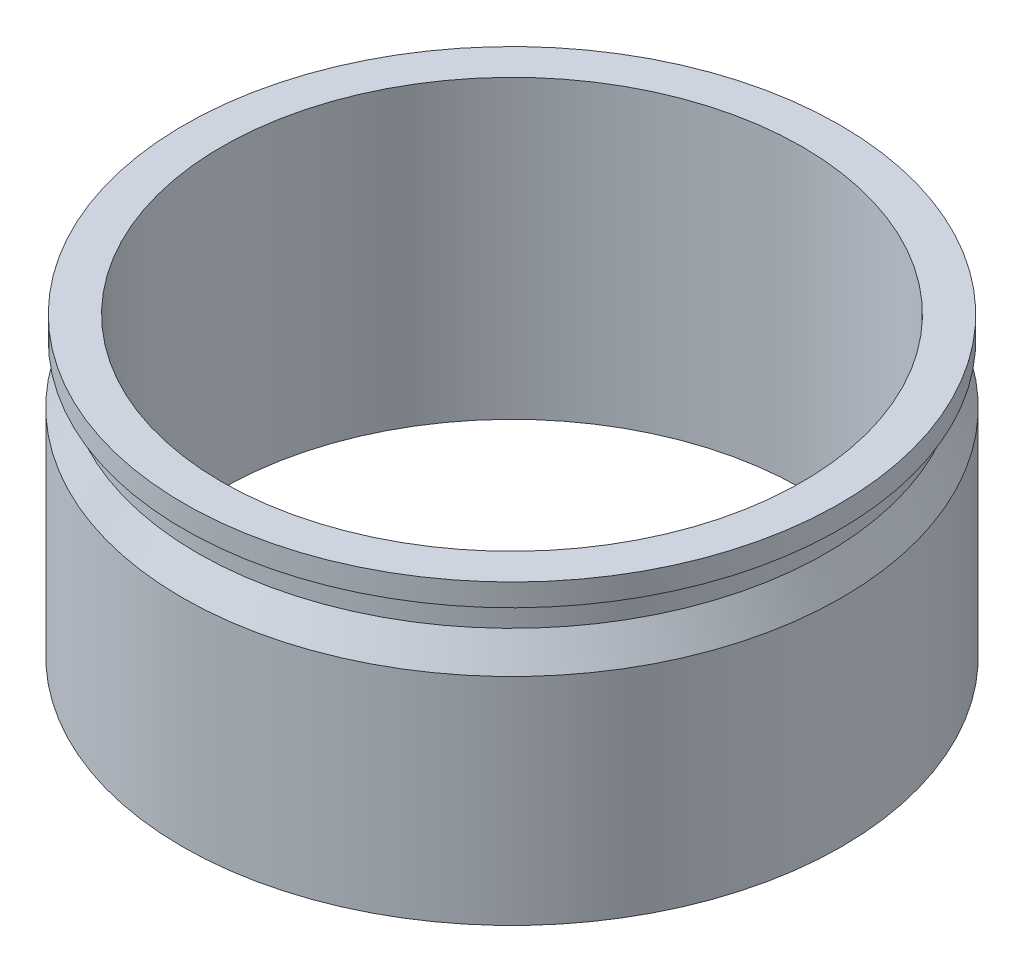
ISO-10303-21;
HEADER;
FILE_DESCRIPTION(('STEP AP214'),'2;1');
FILE_NAME('part.step','',(''),(''),'','','');
FILE_SCHEMA(('AUTOMOTIVE_DESIGN { 1 0 10303 214 1 1 1 1 }'));
ENDSEC;
DATA;
#1=APPLICATION_CONTEXT('core data for automotive mechanical design processes');
#2=APPLICATION_PROTOCOL_DEFINITION('international standard','automotive_design',2000,#1);
#3=PRODUCT_CONTEXT('',#1,'mechanical');
#4=PRODUCT('Part','Part','',(#3));
#5=PRODUCT_RELATED_PRODUCT_CATEGORY('part','',(#4));
#6=PRODUCT_DEFINITION_FORMATION('','',#4);
#7=PRODUCT_DEFINITION_CONTEXT('part definition',#1,'design');
#8=PRODUCT_DEFINITION('design','',#6,#7);
#9=PRODUCT_DEFINITION_SHAPE('','',#8);
#10=(LENGTH_UNIT() NAMED_UNIT(*) SI_UNIT(.MILLI.,.METRE.));
#11=(NAMED_UNIT(*) PLANE_ANGLE_UNIT() SI_UNIT($,.RADIAN.));
#12=(NAMED_UNIT(*) SI_UNIT($,.STERADIAN.) SOLID_ANGLE_UNIT());
#13=UNCERTAINTY_MEASURE_WITH_UNIT(LENGTH_MEASURE(1.E-05),#10,'distance_accuracy_value','');
#14=(GEOMETRIC_REPRESENTATION_CONTEXT(3) GLOBAL_UNCERTAINTY_ASSIGNED_CONTEXT((#13)) GLOBAL_UNIT_ASSIGNED_CONTEXT((#10,
#11,#12)) REPRESENTATION_CONTEXT('',''));
#15=CARTESIAN_POINT('',(0.,0.,0.));
#16=DIRECTION('',(0.,0.,1.));
#17=DIRECTION('',(1.,0.,0.));
#18=AXIS2_PLACEMENT_3D('',#15,#16,#17);
#19=CARTESIAN_POINT('',(-368.749999999999,1707.8376320396,0.));
#20=DIRECTION('',(0.,1.,0.));
#21=DIRECTION('',(0.,0.,1.));
#22=AXIS2_PLACEMENT_3D('',#19,#20,#21);
#23=PLANE('',#22);
#24=CARTESIAN_POINT('',(0.,1707.8376320396,0.));
#25=DIRECTION('',(0.,-1.,0.));
#26=DIRECTION('',(0.,0.,-1.));
#27=AXIS2_PLACEMENT_3D('',#24,#25,#26);
#28=CIRCLE('',#27,325.5);
#29=CARTESIAN_POINT('',(0.,1707.8376320396,-325.500000000001));
#30=VERTEX_POINT('',#29);
#31=EDGE_CURVE('E10',#30,#30,#28,.T.);
#32=ORIENTED_EDGE('',*,*,#31,.F.);
#33=EDGE_LOOP('',(#32));
#34=FACE_BOUND('',#33,.T.);
#35=CARTESIAN_POINT('',(0.,1707.8376320396,0.));
#36=DIRECTION('',(0.,-1.,0.));
#37=DIRECTION('',(0.,0.,-1.));
#38=AXIS2_PLACEMENT_3D('',#35,#36,#37);
#39=CIRCLE('',#38,369.75);
#40=CARTESIAN_POINT('',(0.,1707.8376320396,-369.750000000001));
#41=VERTEX_POINT('',#40);
#42=EDGE_CURVE('E59',#41,#41,#39,.T.);
#43=ORIENTED_EDGE('',*,*,#42,.T.);
#44=EDGE_LOOP('',(#43));
#45=FACE_BOUND('',#44,.T.);
#46=ADVANCED_FACE('F31',(#34,#45),#23,.F.);
#47=CARTESIAN_POINT('',(0.,1764.,0.));
#48=DIRECTION('',(0.,-1.,0.));
#49=DIRECTION('',(0.,0.,-1.));
#50=AXIS2_PLACEMENT_3D('',#47,#48,#49);
#51=CYLINDRICAL_SURFACE('',#50,325.5);
#52=CARTESIAN_POINT('',(0.,2040.,0.));
#53=DIRECTION('',(0.,-1.,0.));
#54=DIRECTION('',(0.,0.,-1.));
#55=AXIS2_PLACEMENT_3D('',#52,#53,#54);
#56=CIRCLE('',#55,325.5);
#57=CARTESIAN_POINT('',(0.,2040.,-325.500000000001));
#58=VERTEX_POINT('',#57);
#59=EDGE_CURVE('E37',#58,#58,#56,.T.);
#60=ORIENTED_EDGE('',*,*,#59,.F.);
#61=EDGE_LOOP('',(#60));
#62=FACE_BOUND('',#61,.T.);
#63=ORIENTED_EDGE('',*,*,#31,.T.);
#64=EDGE_LOOP('',(#63));
#65=FACE_BOUND('',#64,.T.);
#66=ADVANCED_FACE('F127',(#62,#65),#51,.F.);
#67=CARTESIAN_POINT('',(-326.499999999999,2040.,0.));
#68=DIRECTION('',(0.,-1.,0.));
#69=DIRECTION('',(0.,0.,-1.));
#70=AXIS2_PLACEMENT_3D('',#67,#68,#69);
#71=PLANE('',#70);
#72=CARTESIAN_POINT('',(0.,2040.,0.));
#73=DIRECTION('',(0.,-1.,0.));
#74=DIRECTION('',(0.,0.,-1.));
#75=AXIS2_PLACEMENT_3D('',#72,#73,#74);
#76=CIRCLE('',#75,367.75);
#77=CARTESIAN_POINT('',(0.,2040.,-367.750000000001));
#78=VERTEX_POINT('',#77);
#79=EDGE_CURVE('E41',#78,#78,#76,.T.);
#80=ORIENTED_EDGE('',*,*,#79,.F.);
#81=EDGE_LOOP('',(#80));
#82=FACE_BOUND('',#81,.T.);
#83=ORIENTED_EDGE('',*,*,#59,.T.);
#84=EDGE_LOOP('',(#83));
#85=FACE_BOUND('',#84,.T.);
#86=ADVANCED_FACE('F124',(#82,#85),#71,.F.);
#87=CARTESIAN_POINT('',(0.,1764.,0.));
#88=DIRECTION('',(0.,-1.,0.));
#89=DIRECTION('',(0.,0.,-1.));
#90=AXIS2_PLACEMENT_3D('',#87,#88,#89);
#91=CYLINDRICAL_SURFACE('',#90,367.75);
#92=CARTESIAN_POINT('',(0.,2015.,0.));
#93=DIRECTION('',(0.,-1.,0.));
#94=DIRECTION('',(0.,0.,-1.));
#95=AXIS2_PLACEMENT_3D('',#92,#93,#94);
#96=CIRCLE('',#95,367.75);
#97=CARTESIAN_POINT('',(0.,2015.,-367.750000000001));
#98=VERTEX_POINT('',#97);
#99=EDGE_CURVE('E45',#98,#98,#96,.T.);
#100=ORIENTED_EDGE('',*,*,#99,.F.);
#101=EDGE_LOOP('',(#100));
#102=FACE_BOUND('',#101,.T.);
#103=ORIENTED_EDGE('',*,*,#79,.T.);
#104=EDGE_LOOP('',(#103));
#105=FACE_BOUND('',#104,.T.);
#106=ADVANCED_FACE('F120',(#102,#105),#91,.T.);
#107=CARTESIAN_POINT('',(-366.75,2015.,0.));
#108=DIRECTION('',(0.,1.,0.));
#109=DIRECTION('',(0.,0.,1.));
#110=AXIS2_PLACEMENT_3D('',#107,#108,#109);
#111=PLANE('',#110);
#112=CARTESIAN_POINT('',(0.,2015.,0.));
#113=DIRECTION('',(0.,-1.,0.));
#114=DIRECTION('',(0.,0.,-1.));
#115=AXIS2_PLACEMENT_3D('',#112,#113,#114);
#116=CIRCLE('',#115,352.5);
#117=CARTESIAN_POINT('',(0.,2015.,-352.500000000001));
#118=VERTEX_POINT('',#117);
#119=EDGE_CURVE('E50',#118,#118,#116,.T.);
#120=ORIENTED_EDGE('',*,*,#119,.F.);
#121=EDGE_LOOP('',(#120));
#122=FACE_BOUND('',#121,.T.);
#123=ORIENTED_EDGE('',*,*,#99,.T.);
#124=EDGE_LOOP('',(#123));
#125=FACE_BOUND('',#124,.T.);
#126=ADVANCED_FACE('F116',(#122,#125),#111,.F.);
#127=CARTESIAN_POINT('',(0.,1764.,0.));
#128=DIRECTION('',(0.,-1.,0.));
#129=DIRECTION('',(0.,0.,-1.));
#130=AXIS2_PLACEMENT_3D('',#127,#128,#129);
#131=CYLINDRICAL_SURFACE('',#130,352.5);
#132=CARTESIAN_POINT('',(0.,1984.23545746066,0.));
#133=DIRECTION('',(0.,-1.,0.));
#134=DIRECTION('',(0.,0.,-1.));
#135=AXIS2_PLACEMENT_3D('',#132,#133,#134);
#136=CIRCLE('',#135,352.5);
#137=CARTESIAN_POINT('',(0.,1984.23545746066,-352.500000000001));
#138=VERTEX_POINT('',#137);
#139=EDGE_CURVE('E53',#138,#138,#136,.T.);
#140=ORIENTED_EDGE('',*,*,#139,.F.);
#141=EDGE_LOOP('',(#140));
#142=FACE_BOUND('',#141,.T.);
#143=ORIENTED_EDGE('',*,*,#119,.T.);
#144=EDGE_LOOP('',(#143));
#145=FACE_BOUND('',#144,.T.);
#146=ADVANCED_FACE('F112',(#142,#145),#131,.T.);
#147=CARTESIAN_POINT('',(0.,1984.23545746066,0.));
#148=DIRECTION('',(0.,-1.,0.));
#149=DIRECTION('',(0.,0.,-1.));
#150=AXIS2_PLACEMENT_3D('',#147,#148,#149);
#151=CONICAL_SURFACE('',#150,352.5,0.462490871517885);
#152=CARTESIAN_POINT('',(0.,1949.63545746066,0.));
#153=DIRECTION('',(0.,-1.,0.));
#154=DIRECTION('',(0.,0.,-1.));
#155=AXIS2_PLACEMENT_3D('',#152,#153,#154);
#156=CIRCLE('',#155,369.75);
#157=CARTESIAN_POINT('',(0.,1949.63545746066,-369.750000000001));
#158=VERTEX_POINT('',#157);
#159=EDGE_CURVE('E56',#158,#158,#156,.T.);
#160=ORIENTED_EDGE('',*,*,#159,.F.);
#161=EDGE_LOOP('',(#160));
#162=FACE_BOUND('',#161,.T.);
#163=ORIENTED_EDGE('',*,*,#139,.T.);
#164=EDGE_LOOP('',(#163));
#165=FACE_BOUND('',#164,.T.);
#166=ADVANCED_FACE('F108',(#162,#165),#151,.T.);
#167=CARTESIAN_POINT('',(0.,1764.,0.));
#168=DIRECTION('',(0.,-1.,0.));
#169=DIRECTION('',(0.,0.,-1.));
#170=AXIS2_PLACEMENT_3D('',#167,#168,#169);
#171=CYLINDRICAL_SURFACE('',#170,369.75);
#172=ORIENTED_EDGE('',*,*,#42,.F.);
#173=EDGE_LOOP('',(#172));
#174=FACE_BOUND('',#173,.T.);
#175=ORIENTED_EDGE('',*,*,#159,.T.);
#176=EDGE_LOOP('',(#175));
#177=FACE_BOUND('',#176,.T.);
#178=ADVANCED_FACE('F106',(#174,#177),#171,.T.);
#179=CLOSED_SHELL('',(#46,#66,#86,#106,#126,#146,#166,#178));
#180=CARTESIAN_POINT('',(-368.749999999999,1708.8376320396,0.));
#181=DIRECTION('',(0.,1.,0.));
#182=DIRECTION('',(0.,0.,1.));
#183=AXIS2_PLACEMENT_3D('',#180,#181,#182);
#184=PLANE('',#183);
#185=CARTESIAN_POINT('',(0.,1708.8376320396,0.));
#186=DIRECTION('',(0.,-1.,0.));
#187=DIRECTION('',(0.,0.,-1.));
#188=AXIS2_PLACEMENT_3D('',#185,#186,#187);
#189=CIRCLE('',#188,326.5);
#190=CARTESIAN_POINT('',(0.,1708.8376320396,-326.500000000001));
#191=VERTEX_POINT('',#190);
#192=EDGE_CURVE('E62',#191,#191,#189,.T.);
#193=ORIENTED_EDGE('',*,*,#192,.T.);
#194=EDGE_LOOP('',(#193));
#195=FACE_BOUND('',#194,.T.);
#196=CARTESIAN_POINT('',(0.,1708.8376320396,0.));
#197=DIRECTION('',(0.,-1.,0.));
#198=DIRECTION('',(0.,0.,-1.));
#199=AXIS2_PLACEMENT_3D('',#196,#197,#198);
#200=CIRCLE('',#199,368.75);
#201=CARTESIAN_POINT('',(0.,1708.8376320396,-368.750000000001));
#202=VERTEX_POINT('',#201);
#203=EDGE_CURVE('E83',#202,#202,#200,.T.);
#204=ORIENTED_EDGE('',*,*,#203,.F.);
#205=EDGE_LOOP('',(#204));
#206=FACE_BOUND('',#205,.T.);
#207=ADVANCED_FACE('F90',(#195,#206),#184,.T.);
#208=CARTESIAN_POINT('',(0.,1764.,0.));
#209=DIRECTION('',(0.,-1.,0.));
#210=DIRECTION('',(0.,0.,-1.));
#211=AXIS2_PLACEMENT_3D('',#208,#209,#210);
#212=CYLINDRICAL_SURFACE('',#211,326.5);
#213=CARTESIAN_POINT('',(0.,2039.,0.));
#214=DIRECTION('',(0.,-1.,0.));
#215=DIRECTION('',(0.,0.,-1.));
#216=AXIS2_PLACEMENT_3D('',#213,#214,#215);
#217=CIRCLE('',#216,326.5);
#218=CARTESIAN_POINT('',(0.,2039.,-326.500000000001));
#219=VERTEX_POINT('',#218);
#220=EDGE_CURVE('E65',#219,#219,#217,.T.);
#221=ORIENTED_EDGE('',*,*,#220,.T.);
#222=EDGE_LOOP('',(#221));
#223=FACE_BOUND('',#222,.T.);
#224=ORIENTED_EDGE('',*,*,#192,.F.);
#225=EDGE_LOOP('',(#224));
#226=FACE_BOUND('',#225,.T.);
#227=ADVANCED_FACE('F92',(#223,#226),#212,.T.);
#228=CARTESIAN_POINT('',(-326.499999999999,2039.,0.));
#229=DIRECTION('',(0.,-1.,0.));
#230=DIRECTION('',(0.,0.,-1.));
#231=AXIS2_PLACEMENT_3D('',#228,#229,#230);
#232=PLANE('',#231);
#233=CARTESIAN_POINT('',(0.,2039.,0.));
#234=DIRECTION('',(0.,-1.,0.));
#235=DIRECTION('',(0.,0.,-1.));
#236=AXIS2_PLACEMENT_3D('',#233,#234,#235);
#237=CIRCLE('',#236,366.75);
#238=CARTESIAN_POINT('',(0.,2039.,-366.750000000001));
#239=VERTEX_POINT('',#238);
#240=EDGE_CURVE('E68',#239,#239,#237,.T.);
#241=ORIENTED_EDGE('',*,*,#240,.T.);
#242=EDGE_LOOP('',(#241));
#243=FACE_BOUND('',#242,.T.);
#244=ORIENTED_EDGE('',*,*,#220,.F.);
#245=EDGE_LOOP('',(#244));
#246=FACE_BOUND('',#245,.T.);
#247=ADVANCED_FACE('F100',(#243,#246),#232,.T.);
#248=CARTESIAN_POINT('',(0.,1764.,0.));
#249=DIRECTION('',(0.,-1.,0.));
#250=DIRECTION('',(0.,0.,-1.));
#251=AXIS2_PLACEMENT_3D('',#248,#249,#250);
#252=CYLINDRICAL_SURFACE('',#251,366.75);
#253=CARTESIAN_POINT('',(0.,2016.,0.));
#254=DIRECTION('',(0.,-1.,0.));
#255=DIRECTION('',(0.,0.,-1.));
#256=AXIS2_PLACEMENT_3D('',#253,#254,#255);
#257=CIRCLE('',#256,366.75);
#258=CARTESIAN_POINT('',(0.,2016.,-366.750000000001));
#259=VERTEX_POINT('',#258);
#260=EDGE_CURVE('E71',#259,#259,#257,.T.);
#261=ORIENTED_EDGE('',*,*,#260,.T.);
#262=EDGE_LOOP('',(#261));
#263=FACE_BOUND('',#262,.T.);
#264=ORIENTED_EDGE('',*,*,#240,.F.);
#265=EDGE_LOOP('',(#264));
#266=FACE_BOUND('',#265,.T.);
#267=ADVANCED_FACE('F208',(#263,#266),#252,.F.);
#268=CARTESIAN_POINT('',(-366.75,2016.,0.));
#269=DIRECTION('',(0.,1.,0.));
#270=DIRECTION('',(0.,0.,1.));
#271=AXIS2_PLACEMENT_3D('',#268,#269,#270);
#272=PLANE('',#271);
#273=CARTESIAN_POINT('',(0.,2016.,0.));
#274=DIRECTION('',(0.,-1.,0.));
#275=DIRECTION('',(0.,0.,-1.));
#276=AXIS2_PLACEMENT_3D('',#273,#274,#275);
#277=CIRCLE('',#276,351.5);
#278=CARTESIAN_POINT('',(0.,2016.,-351.500000000001));
#279=VERTEX_POINT('',#278);
#280=EDGE_CURVE('E74',#279,#279,#277,.T.);
#281=ORIENTED_EDGE('',*,*,#280,.T.);
#282=EDGE_LOOP('',(#281));
#283=FACE_BOUND('',#282,.T.);
#284=ORIENTED_EDGE('',*,*,#260,.F.);
#285=EDGE_LOOP('',(#284));
#286=FACE_BOUND('',#285,.T.);
#287=ADVANCED_FACE('F217',(#283,#286),#272,.T.);
#288=CARTESIAN_POINT('',(0.,1764.,0.));
#289=DIRECTION('',(0.,-1.,0.));
#290=DIRECTION('',(0.,0.,-1.));
#291=AXIS2_PLACEMENT_3D('',#288,#289,#290);
#292=CYLINDRICAL_SURFACE('',#291,351.5);
#293=CARTESIAN_POINT('',(0.,1984.,0.));
#294=DIRECTION('',(0.,-1.,0.));
#295=DIRECTION('',(0.,0.,-1.));
#296=AXIS2_PLACEMENT_3D('',#293,#294,#295);
#297=CIRCLE('',#296,351.5);
#298=CARTESIAN_POINT('',(0.,1984.,-351.500000000001));
#299=VERTEX_POINT('',#298);
#300=EDGE_CURVE('E77',#299,#299,#297,.T.);
#301=ORIENTED_EDGE('',*,*,#300,.T.);
#302=EDGE_LOOP('',(#301));
#303=FACE_BOUND('',#302,.T.);
#304=ORIENTED_EDGE('',*,*,#280,.F.);
#305=EDGE_LOOP('',(#304));
#306=FACE_BOUND('',#305,.T.);
#307=ADVANCED_FACE('F227',(#303,#306),#292,.F.);
#308=CARTESIAN_POINT('',(0.,1984.,0.));
#309=DIRECTION('',(0.,-1.,0.));
#310=DIRECTION('',(0.,0.,-1.));
#311=AXIS2_PLACEMENT_3D('',#308,#309,#310);
#312=CONICAL_SURFACE('',#311,351.5,0.462490871517885);
#313=CARTESIAN_POINT('',(0.,1949.4,0.));
#314=DIRECTION('',(0.,-1.,0.));
#315=DIRECTION('',(0.,0.,-1.));
#316=AXIS2_PLACEMENT_3D('',#313,#314,#315);
#317=CIRCLE('',#316,368.75);
#318=CARTESIAN_POINT('',(0.,1949.4,-368.750000000001));
#319=VERTEX_POINT('',#318);
#320=EDGE_CURVE('E80',#319,#319,#317,.T.);
#321=ORIENTED_EDGE('',*,*,#320,.T.);
#322=EDGE_LOOP('',(#321));
#323=FACE_BOUND('',#322,.T.);
#324=ORIENTED_EDGE('',*,*,#300,.F.);
#325=EDGE_LOOP('',(#324));
#326=FACE_BOUND('',#325,.T.);
#327=ADVANCED_FACE('F237',(#323,#326),#312,.F.);
#328=CARTESIAN_POINT('',(0.,1764.,0.));
#329=DIRECTION('',(0.,-1.,0.));
#330=DIRECTION('',(0.,0.,-1.));
#331=AXIS2_PLACEMENT_3D('',#328,#329,#330);
#332=CYLINDRICAL_SURFACE('',#331,368.75);
#333=ORIENTED_EDGE('',*,*,#203,.T.);
#334=EDGE_LOOP('',(#333));
#335=FACE_BOUND('',#334,.T.);
#336=ORIENTED_EDGE('',*,*,#320,.F.);
#337=EDGE_LOOP('',(#336));
#338=FACE_BOUND('',#337,.T.);
#339=ADVANCED_FACE('F87',(#335,#338),#332,.F.);
#340=CLOSED_SHELL('',(#207,#227,#247,#267,#287,#307,#327,#339));
#341=ORIENTED_CLOSED_SHELL('',*,#340,.T.);
#342=BREP_WITH_VOIDS('B2',#179,(#341));
#343=ADVANCED_BREP_SHAPE_REPRESENTATION('',(#18,#342),#14);
#344=SHAPE_DEFINITION_REPRESENTATION(#9,#343);
ENDSEC;
END-ISO-10303-21;
